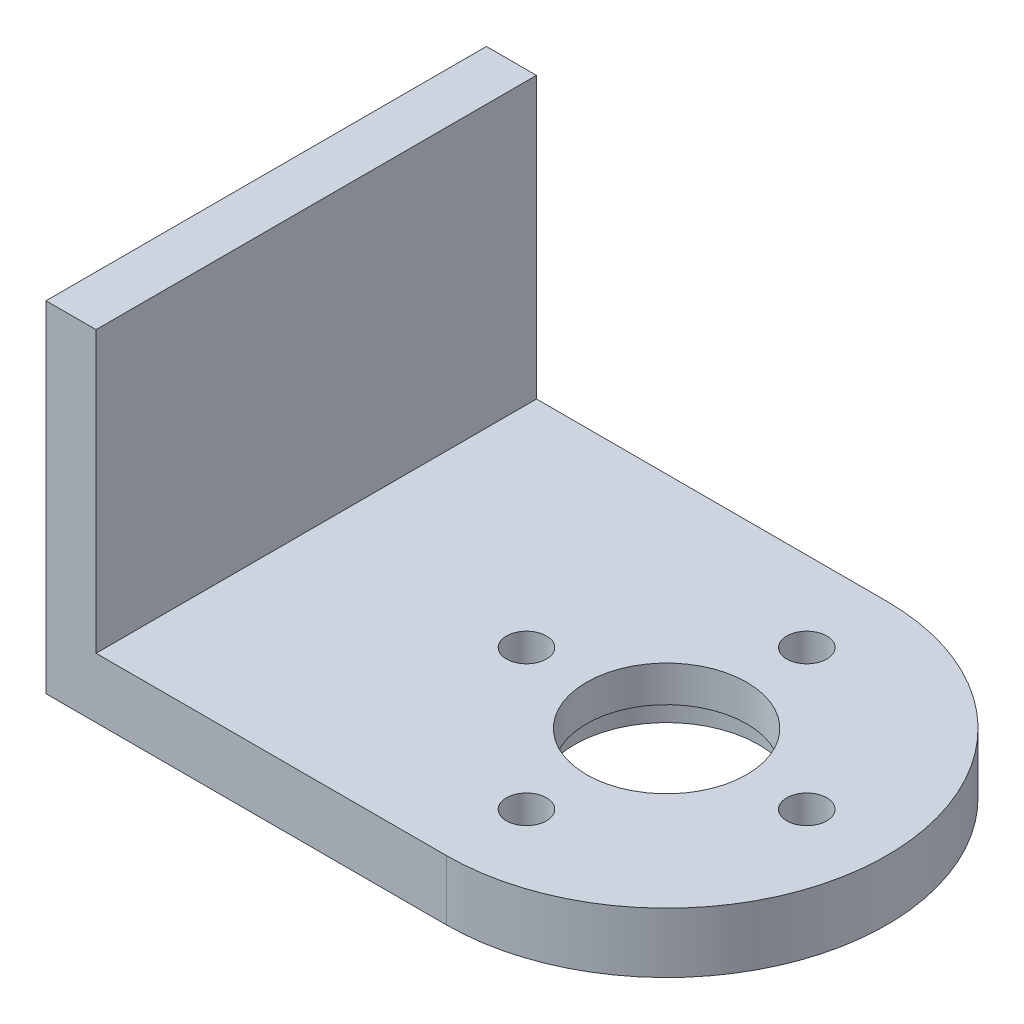
ISO-10303-21;
HEADER;
FILE_DESCRIPTION(('STEP AP214'),'2;1');
FILE_NAME('part.step','',(''),(''),'','','');
FILE_SCHEMA(('AUTOMOTIVE_DESIGN { 1 0 10303 214 1 1 1 1 }'));
ENDSEC;
DATA;
#1=APPLICATION_CONTEXT('core data for automotive mechanical design processes');
#2=APPLICATION_PROTOCOL_DEFINITION('international standard','automotive_design',2000,#1);
#3=PRODUCT_CONTEXT('',#1,'mechanical');
#4=PRODUCT('Part','Part','',(#3));
#5=PRODUCT_RELATED_PRODUCT_CATEGORY('part','',(#4));
#6=PRODUCT_DEFINITION_FORMATION('','',#4);
#7=PRODUCT_DEFINITION_CONTEXT('part definition',#1,'design');
#8=PRODUCT_DEFINITION('design','',#6,#7);
#9=PRODUCT_DEFINITION_SHAPE('','',#8);
#10=(LENGTH_UNIT() NAMED_UNIT(*) SI_UNIT(.MILLI.,.METRE.));
#11=(NAMED_UNIT(*) PLANE_ANGLE_UNIT() SI_UNIT($,.RADIAN.));
#12=(NAMED_UNIT(*) SI_UNIT($,.STERADIAN.) SOLID_ANGLE_UNIT());
#13=UNCERTAINTY_MEASURE_WITH_UNIT(LENGTH_MEASURE(1.E-05),#10,'distance_accuracy_value','');
#14=(GEOMETRIC_REPRESENTATION_CONTEXT(3) GLOBAL_UNCERTAINTY_ASSIGNED_CONTEXT((#13)) GLOBAL_UNIT_ASSIGNED_CONTEXT((#10,
#11,#12)) REPRESENTATION_CONTEXT('',''));
#15=CARTESIAN_POINT('',(0.,0.,0.));
#16=DIRECTION('',(0.,0.,1.));
#17=DIRECTION('',(1.,0.,0.));
#18=AXIS2_PLACEMENT_3D('',#15,#16,#17);
#19=CARTESIAN_POINT('',(5.99999999999998,3.,7.));
#20=DIRECTION('',(0.,-1.,0.));
#21=DIRECTION('',(0.,0.,-1.));
#22=AXIS2_PLACEMENT_3D('',#19,#20,#21);
#23=CYLINDRICAL_SURFACE('',#22,1.);
#24=CARTESIAN_POINT('',(5.99999999999998,3.,7.));
#25=DIRECTION('',(0.,1.,0.));
#26=DIRECTION('',(0.,0.,1.));
#27=AXIS2_PLACEMENT_3D('',#24,#25,#26);
#28=CIRCLE('',#27,1.);
#29=CARTESIAN_POINT('',(5.99999999999998,3.,8.));
#30=VERTEX_POINT('',#29);
#31=EDGE_CURVE('E171',#30,#30,#28,.T.);
#32=ORIENTED_EDGE('',*,*,#31,.T.);
#33=EDGE_LOOP('',(#32));
#34=FACE_BOUND('',#33,.T.);
#35=CARTESIAN_POINT('',(5.99999999999998,1.5,7.));
#36=DIRECTION('',(0.,-1.,0.));
#37=DIRECTION('',(0.,0.,-1.));
#38=AXIS2_PLACEMENT_3D('',#35,#36,#37);
#39=CIRCLE('',#38,1.);
#40=CARTESIAN_POINT('',(5.99999999999998,1.5,6.));
#41=VERTEX_POINT('',#40);
#42=EDGE_CURVE('E38',#41,#41,#39,.T.);
#43=ORIENTED_EDGE('',*,*,#42,.T.);
#44=EDGE_LOOP('',(#43));
#45=FACE_BOUND('',#44,.T.);
#46=ADVANCED_FACE('F34',(#34,#45),#23,.F.);
#47=CARTESIAN_POINT('',(-1.,3.,0.));
#48=DIRECTION('',(0.,-1.,0.));
#49=DIRECTION('',(0.,0.,-1.));
#50=AXIS2_PLACEMENT_3D('',#47,#48,#49);
#51=CYLINDRICAL_SURFACE('',#50,1.);
#52=CARTESIAN_POINT('',(-1.,3.,0.));
#53=DIRECTION('',(0.,1.,0.));
#54=DIRECTION('',(0.,0.,1.));
#55=AXIS2_PLACEMENT_3D('',#52,#53,#54);
#56=CIRCLE('',#55,1.);
#57=CARTESIAN_POINT('',(-1.,3.,0.999999999999951));
#58=VERTEX_POINT('',#57);
#59=EDGE_CURVE('E168',#58,#58,#56,.T.);
#60=ORIENTED_EDGE('',*,*,#59,.T.);
#61=EDGE_LOOP('',(#60));
#62=FACE_BOUND('',#61,.T.);
#63=CARTESIAN_POINT('',(-1.,1.5,0.));
#64=DIRECTION('',(0.,-1.,0.));
#65=DIRECTION('',(0.,0.,-1.));
#66=AXIS2_PLACEMENT_3D('',#63,#64,#65);
#67=CIRCLE('',#66,1.);
#68=CARTESIAN_POINT('',(-1.,1.5,-1.00000000000005));
#69=VERTEX_POINT('',#68);
#70=EDGE_CURVE('E128',#69,#69,#67,.T.);
#71=ORIENTED_EDGE('',*,*,#70,.T.);
#72=EDGE_LOOP('',(#71));
#73=FACE_BOUND('',#72,.T.);
#74=ADVANCED_FACE('F204',(#62,#73),#51,.F.);
#75=CARTESIAN_POINT('',(6.00000000000008,3.,-7.));
#76=DIRECTION('',(0.,-1.,0.));
#77=DIRECTION('',(0.,0.,-1.));
#78=AXIS2_PLACEMENT_3D('',#75,#76,#77);
#79=CYLINDRICAL_SURFACE('',#78,1.);
#80=CARTESIAN_POINT('',(6.00000000000008,3.,-7.));
#81=DIRECTION('',(0.,1.,0.));
#82=DIRECTION('',(0.,0.,1.));
#83=AXIS2_PLACEMENT_3D('',#80,#81,#82);
#84=CIRCLE('',#83,1.);
#85=CARTESIAN_POINT('',(6.00000000000008,3.,-6.));
#86=VERTEX_POINT('',#85);
#87=EDGE_CURVE('E165',#86,#86,#84,.T.);
#88=ORIENTED_EDGE('',*,*,#87,.T.);
#89=EDGE_LOOP('',(#88));
#90=FACE_BOUND('',#89,.T.);
#91=CARTESIAN_POINT('',(6.00000000000008,1.5,-7.));
#92=DIRECTION('',(0.,-1.,0.));
#93=DIRECTION('',(0.,0.,-1.));
#94=AXIS2_PLACEMENT_3D('',#91,#92,#93);
#95=CIRCLE('',#94,1.);
#96=CARTESIAN_POINT('',(6.00000000000008,1.5,-8.));
#97=VERTEX_POINT('',#96);
#98=EDGE_CURVE('E126',#97,#97,#95,.T.);
#99=ORIENTED_EDGE('',*,*,#98,.T.);
#100=EDGE_LOOP('',(#99));
#101=FACE_BOUND('',#100,.T.);
#102=ADVANCED_FACE('F210',(#90,#101),#79,.F.);
#103=CARTESIAN_POINT('',(13.,3.,0.));
#104=DIRECTION('',(0.,-1.,0.));
#105=DIRECTION('',(0.,0.,-1.));
#106=AXIS2_PLACEMENT_3D('',#103,#104,#105);
#107=CYLINDRICAL_SURFACE('',#106,1.);
#108=CARTESIAN_POINT('',(13.,3.,0.));
#109=DIRECTION('',(0.,1.,0.));
#110=DIRECTION('',(0.,0.,1.));
#111=AXIS2_PLACEMENT_3D('',#108,#109,#110);
#112=CIRCLE('',#111,1.);
#113=CARTESIAN_POINT('',(13.,3.,1.));
#114=VERTEX_POINT('',#113);
#115=EDGE_CURVE('E104',#114,#114,#112,.T.);
#116=ORIENTED_EDGE('',*,*,#115,.T.);
#117=EDGE_LOOP('',(#116));
#118=FACE_BOUND('',#117,.T.);
#119=CARTESIAN_POINT('',(13.,1.5,0.));
#120=DIRECTION('',(0.,-1.,0.));
#121=DIRECTION('',(0.,0.,-1.));
#122=AXIS2_PLACEMENT_3D('',#119,#120,#121);
#123=CIRCLE('',#122,1.);
#124=CARTESIAN_POINT('',(13.,1.5,-1.));
#125=VERTEX_POINT('',#124);
#126=EDGE_CURVE('E121',#125,#125,#123,.T.);
#127=ORIENTED_EDGE('',*,*,#126,.T.);
#128=EDGE_LOOP('',(#127));
#129=FACE_BOUND('',#128,.T.);
#130=ADVANCED_FACE('F218',(#118,#129),#107,.F.);
#131=CARTESIAN_POINT('',(6.,3.,0.));
#132=DIRECTION('',(0.,-1.,0.));
#133=DIRECTION('',(0.,0.,-1.));
#134=AXIS2_PLACEMENT_3D('',#131,#132,#133);
#135=CYLINDRICAL_SURFACE('',#134,4.);
#136=CARTESIAN_POINT('',(6.,3.,0.));
#137=DIRECTION('',(0.,1.,0.));
#138=DIRECTION('',(0.,0.,1.));
#139=AXIS2_PLACEMENT_3D('',#136,#137,#138);
#140=CIRCLE('',#139,4.);
#141=CARTESIAN_POINT('',(6.,3.,4.));
#142=VERTEX_POINT('',#141);
#143=EDGE_CURVE('E108',#142,#142,#140,.T.);
#144=ORIENTED_EDGE('',*,*,#143,.T.);
#145=EDGE_LOOP('',(#144));
#146=FACE_BOUND('',#145,.T.);
#147=CARTESIAN_POINT('',(6.,1.2,0.));
#148=DIRECTION('',(0.,-1.,0.));
#149=DIRECTION('',(0.,0.,-1.));
#150=AXIS2_PLACEMENT_3D('',#147,#148,#149);
#151=CIRCLE('',#150,4.);
#152=CARTESIAN_POINT('',(6.,1.2,-4.));
#153=VERTEX_POINT('',#152);
#154=EDGE_CURVE('E117',#153,#153,#151,.T.);
#155=ORIENTED_EDGE('',*,*,#154,.T.);
#156=EDGE_LOOP('',(#155));
#157=FACE_BOUND('',#156,.T.);
#158=ADVANCED_FACE('F215',(#146,#157),#135,.F.);
#159=CARTESIAN_POINT('',(6.,3.,0.));
#160=DIRECTION('',(0.,1.,0.));
#161=DIRECTION('',(0.,0.,1.));
#162=AXIS2_PLACEMENT_3D('',#159,#160,#161);
#163=PLANE('',#162);
#164=DIRECTION('',(0.,0.,-1.));
#165=VECTOR('',#164,1.);
#166=CARTESIAN_POINT('',(-11.5,3.,-11.));
#167=LINE('',#166,#165);
#168=CARTESIAN_POINT('',(-11.5,3.,11.));
#169=VERTEX_POINT('',#168);
#170=CARTESIAN_POINT('',(-11.5,3.,-11.));
#171=VERTEX_POINT('',#170);
#172=EDGE_CURVE('E51',#169,#171,#167,.T.);
#173=ORIENTED_EDGE('',*,*,#172,.F.);
#174=DIRECTION('',(1.,0.,0.));
#175=VECTOR('',#174,1.);
#176=CARTESIAN_POINT('',(6.,3.,11.));
#177=LINE('',#176,#175);
#178=CARTESIAN_POINT('',(6.,3.,11.));
#179=VERTEX_POINT('',#178);
#180=EDGE_CURVE('E89',#169,#179,#177,.T.);
#181=ORIENTED_EDGE('',*,*,#180,.T.);
#182=CARTESIAN_POINT('',(6.,3.,0.));
#183=DIRECTION('',(0.,1.,0.));
#184=DIRECTION('',(0.,0.,1.));
#185=AXIS2_PLACEMENT_3D('',#182,#183,#184);
#186=CIRCLE('',#185,11.);
#187=CARTESIAN_POINT('',(6.,3.,-11.));
#188=VERTEX_POINT('',#187);
#189=EDGE_CURVE('E57',#179,#188,#186,.T.);
#190=ORIENTED_EDGE('',*,*,#189,.T.);
#191=DIRECTION('',(-1.,0.,0.));
#192=VECTOR('',#191,1.);
#193=CARTESIAN_POINT('',(-14.,3.,-11.));
#194=LINE('',#193,#192);
#195=EDGE_CURVE('E100',#188,#171,#194,.T.);
#196=ORIENTED_EDGE('',*,*,#195,.T.);
#197=EDGE_LOOP('',(#173,#181,#190,#196));
#198=FACE_BOUND('',#197,.T.);
#199=ORIENTED_EDGE('',*,*,#59,.F.);
#200=EDGE_LOOP('',(#199));
#201=FACE_BOUND('',#200,.T.);
#202=ORIENTED_EDGE('',*,*,#143,.F.);
#203=EDGE_LOOP('',(#202));
#204=FACE_BOUND('',#203,.T.);
#205=ORIENTED_EDGE('',*,*,#115,.F.);
#206=EDGE_LOOP('',(#205));
#207=FACE_BOUND('',#206,.T.);
#208=ORIENTED_EDGE('',*,*,#31,.F.);
#209=EDGE_LOOP('',(#208));
#210=FACE_BOUND('',#209,.T.);
#211=ORIENTED_EDGE('',*,*,#87,.F.);
#212=EDGE_LOOP('',(#211));
#213=FACE_BOUND('',#212,.T.);
#214=ADVANCED_FACE('F178',(#198,#201,#204,#207,#210,#213),#163,.T.);
#215=CARTESIAN_POINT('',(6.,0.,0.));
#216=DIRECTION('',(0.,1.,0.));
#217=DIRECTION('',(0.,0.,1.));
#218=AXIS2_PLACEMENT_3D('',#215,#216,#217);
#219=PLANE('',#218);
#220=CARTESIAN_POINT('',(5.99999999999415,0.,-6.99999999999538));
#221=DIRECTION('',(0.,-1.,0.));
#222=DIRECTION('',(0.,0.,-1.));
#223=AXIS2_PLACEMENT_3D('',#220,#221,#222);
#224=CIRCLE('',#223,1.9);
#225=CARTESIAN_POINT('',(5.99999999999415,0.,-8.89999999999538));
#226=VERTEX_POINT('',#225);
#227=EDGE_CURVE('E256',#226,#226,#224,.T.);
#228=ORIENTED_EDGE('',*,*,#227,.F.);
#229=EDGE_LOOP('',(#228));
#230=FACE_BOUND('',#229,.T.);
#231=CARTESIAN_POINT('',(-1.00000000000121,0.,1.04930458969917E-11));
#232=DIRECTION('',(0.,-1.,0.));
#233=DIRECTION('',(0.,0.,-1.));
#234=AXIS2_PLACEMENT_3D('',#231,#232,#233);
#235=CIRCLE('',#234,1.9);
#236=CARTESIAN_POINT('',(-1.00000000000121,0.,-1.89999999998951));
#237=VERTEX_POINT('',#236);
#238=EDGE_CURVE('E264',#237,#237,#235,.T.);
#239=ORIENTED_EDGE('',*,*,#238,.F.);
#240=EDGE_LOOP('',(#239));
#241=FACE_BOUND('',#240,.T.);
#242=CARTESIAN_POINT('',(6.00000000000469,0.,7.00000000000583));
#243=DIRECTION('',(0.,-1.,0.));
#244=DIRECTION('',(0.,0.,-1.));
#245=AXIS2_PLACEMENT_3D('',#242,#243,#244);
#246=CIRCLE('',#245,1.9);
#247=CARTESIAN_POINT('',(6.00000000000469,0.,5.10000000000583));
#248=VERTEX_POINT('',#247);
#249=EDGE_CURVE('E269',#248,#248,#246,.T.);
#250=ORIENTED_EDGE('',*,*,#249,.F.);
#251=EDGE_LOOP('',(#250));
#252=FACE_BOUND('',#251,.T.);
#253=CARTESIAN_POINT('',(13.,0.,0.));
#254=DIRECTION('',(0.,-1.,0.));
#255=DIRECTION('',(0.,0.,-1.));
#256=AXIS2_PLACEMENT_3D('',#253,#254,#255);
#257=CIRCLE('',#256,1.9);
#258=CARTESIAN_POINT('',(13.,0.,-1.9));
#259=VERTEX_POINT('',#258);
#260=EDGE_CURVE('E134',#259,#259,#257,.T.);
#261=ORIENTED_EDGE('',*,*,#260,.F.);
#262=EDGE_LOOP('',(#261));
#263=FACE_BOUND('',#262,.T.);
#264=CARTESIAN_POINT('',(5.99999999999939,0.,5.22208257912396E-12));
#265=DIRECTION('',(0.,-1.,0.));
#266=DIRECTION('',(0.,0.,-1.));
#267=AXIS2_PLACEMENT_3D('',#264,#265,#266);
#268=CIRCLE('',#267,4.60000000001315);
#269=CARTESIAN_POINT('',(5.99999999999939,0.,-4.60000000000793));
#270=VERTEX_POINT('',#269);
#271=EDGE_CURVE('E124',#270,#270,#268,.T.);
#272=ORIENTED_EDGE('',*,*,#271,.F.);
#273=EDGE_LOOP('',(#272));
#274=FACE_BOUND('',#273,.T.);
#275=DIRECTION('',(1.,0.,0.));
#276=VECTOR('',#275,1.);
#277=CARTESIAN_POINT('',(6.,0.,11.));
#278=LINE('',#277,#276);
#279=CARTESIAN_POINT('',(-14.,0.,11.));
#280=VERTEX_POINT('',#279);
#281=CARTESIAN_POINT('',(6.,0.,11.));
#282=VERTEX_POINT('',#281);
#283=EDGE_CURVE('E95',#280,#282,#278,.T.);
#284=ORIENTED_EDGE('',*,*,#283,.F.);
#285=DIRECTION('',(0.,0.,1.));
#286=VECTOR('',#285,1.);
#287=CARTESIAN_POINT('',(-14.,0.,11.));
#288=LINE('',#287,#286);
#289=CARTESIAN_POINT('',(-14.,0.,-11.));
#290=VERTEX_POINT('',#289);
#291=EDGE_CURVE('E77',#290,#280,#288,.T.);
#292=ORIENTED_EDGE('',*,*,#291,.F.);
#293=DIRECTION('',(-1.,0.,0.));
#294=VECTOR('',#293,1.);
#295=CARTESIAN_POINT('',(-14.,0.,-11.));
#296=LINE('',#295,#294);
#297=CARTESIAN_POINT('',(6.,0.,-11.));
#298=VERTEX_POINT('',#297);
#299=EDGE_CURVE('E90',#298,#290,#296,.T.);
#300=ORIENTED_EDGE('',*,*,#299,.F.);
#301=CARTESIAN_POINT('',(6.,0.,0.));
#302=DIRECTION('',(0.,1.,0.));
#303=DIRECTION('',(0.,0.,1.));
#304=AXIS2_PLACEMENT_3D('',#301,#302,#303);
#305=CIRCLE('',#304,11.);
#306=EDGE_CURVE('E103',#282,#298,#305,.T.);
#307=ORIENTED_EDGE('',*,*,#306,.F.);
#308=EDGE_LOOP('',(#284,#292,#300,#307));
#309=FACE_BOUND('',#308,.T.);
#310=ADVANCED_FACE('F102',(#230,#241,#252,#263,#274,#309),#219,.F.);
#311=CARTESIAN_POINT('',(6.,3.,11.));
#312=DIRECTION('',(0.,0.,-1.));
#313=DIRECTION('',(-1.,0.,0.));
#314=AXIS2_PLACEMENT_3D('',#311,#312,#313);
#315=PLANE('',#314);
#316=ORIENTED_EDGE('',*,*,#283,.T.);
#317=DIRECTION('',(0.,-1.,0.));
#318=VECTOR('',#317,1.);
#319=CARTESIAN_POINT('',(6.,3.,11.));
#320=LINE('',#319,#318);
#321=EDGE_CURVE('E11',#179,#282,#320,.T.);
#322=ORIENTED_EDGE('',*,*,#321,.F.);
#323=ORIENTED_EDGE('',*,*,#180,.F.);
#324=DIRECTION('',(0.,-1.,0.));
#325=VECTOR('',#324,1.);
#326=CARTESIAN_POINT('',(-11.5,17.,11.));
#327=LINE('',#326,#325);
#328=CARTESIAN_POINT('',(-11.5,17.,11.));
#329=VERTEX_POINT('',#328);
#330=EDGE_CURVE('E162',#329,#169,#327,.T.);
#331=ORIENTED_EDGE('',*,*,#330,.F.);
#332=DIRECTION('',(1.,0.,0.));
#333=VECTOR('',#332,1.);
#334=CARTESIAN_POINT('',(-11.5,17.,11.));
#335=LINE('',#334,#333);
#336=CARTESIAN_POINT('',(-14.,17.,11.));
#337=VERTEX_POINT('',#336);
#338=EDGE_CURVE('E98',#337,#329,#335,.T.);
#339=ORIENTED_EDGE('',*,*,#338,.F.);
#340=DIRECTION('',(0.,-1.,0.));
#341=VECTOR('',#340,1.);
#342=CARTESIAN_POINT('',(-14.,3.,11.));
#343=LINE('',#342,#341);
#344=EDGE_CURVE('E82',#337,#280,#343,.T.);
#345=ORIENTED_EDGE('',*,*,#344,.T.);
#346=EDGE_LOOP('',(#316,#322,#323,#331,#339,#345));
#347=FACE_BOUND('',#346,.T.);
#348=ADVANCED_FACE('F36',(#347),#315,.F.);
#349=CARTESIAN_POINT('',(6.,3.,0.));
#350=DIRECTION('',(0.,-1.,0.));
#351=DIRECTION('',(0.,0.,-1.));
#352=AXIS2_PLACEMENT_3D('',#349,#350,#351);
#353=CYLINDRICAL_SURFACE('',#352,11.);
#354=ORIENTED_EDGE('',*,*,#306,.T.);
#355=DIRECTION('',(0.,-1.,0.));
#356=VECTOR('',#355,1.);
#357=CARTESIAN_POINT('',(6.,3.,-11.));
#358=LINE('',#357,#356);
#359=EDGE_CURVE('E43',#188,#298,#358,.T.);
#360=ORIENTED_EDGE('',*,*,#359,.F.);
#361=ORIENTED_EDGE('',*,*,#189,.F.);
#362=ORIENTED_EDGE('',*,*,#321,.T.);
#363=EDGE_LOOP('',(#354,#360,#361,#362));
#364=FACE_BOUND('',#363,.T.);
#365=ADVANCED_FACE('F196',(#364),#353,.T.);
#366=CARTESIAN_POINT('',(-14.,3.,-11.));
#367=DIRECTION('',(0.,0.,1.));
#368=DIRECTION('',(1.,0.,0.));
#369=AXIS2_PLACEMENT_3D('',#366,#367,#368);
#370=PLANE('',#369);
#371=ORIENTED_EDGE('',*,*,#299,.T.);
#372=DIRECTION('',(0.,-1.,0.));
#373=VECTOR('',#372,1.);
#374=CARTESIAN_POINT('',(-14.,3.,-11.));
#375=LINE('',#374,#373);
#376=CARTESIAN_POINT('',(-14.,17.,-11.));
#377=VERTEX_POINT('',#376);
#378=EDGE_CURVE('E85',#377,#290,#375,.T.);
#379=ORIENTED_EDGE('',*,*,#378,.F.);
#380=DIRECTION('',(-1.,0.,0.));
#381=VECTOR('',#380,1.);
#382=CARTESIAN_POINT('',(-14.,17.,-11.));
#383=LINE('',#382,#381);
#384=CARTESIAN_POINT('',(-11.5,17.,-11.));
#385=VERTEX_POINT('',#384);
#386=EDGE_CURVE('E155',#385,#377,#383,.T.);
#387=ORIENTED_EDGE('',*,*,#386,.F.);
#388=DIRECTION('',(0.,-1.,0.));
#389=VECTOR('',#388,1.);
#390=CARTESIAN_POINT('',(-11.5,17.,-11.));
#391=LINE('',#390,#389);
#392=EDGE_CURVE('E158',#385,#171,#391,.T.);
#393=ORIENTED_EDGE('',*,*,#392,.T.);
#394=ORIENTED_EDGE('',*,*,#195,.F.);
#395=ORIENTED_EDGE('',*,*,#359,.T.);
#396=EDGE_LOOP('',(#371,#379,#387,#393,#394,#395));
#397=FACE_BOUND('',#396,.T.);
#398=ADVANCED_FACE('F187',(#397),#370,.F.);
#399=CARTESIAN_POINT('',(-14.,3.,11.));
#400=DIRECTION('',(1.,0.,0.));
#401=DIRECTION('',(0.,0.,-1.));
#402=AXIS2_PLACEMENT_3D('',#399,#400,#401);
#403=PLANE('',#402);
#404=ORIENTED_EDGE('',*,*,#291,.T.);
#405=ORIENTED_EDGE('',*,*,#344,.F.);
#406=DIRECTION('',(0.,0.,1.));
#407=VECTOR('',#406,1.);
#408=CARTESIAN_POINT('',(-14.,17.,-11.));
#409=LINE('',#408,#407);
#410=EDGE_CURVE('E149',#377,#337,#409,.T.);
#411=ORIENTED_EDGE('',*,*,#410,.F.);
#412=ORIENTED_EDGE('',*,*,#378,.T.);
#413=EDGE_LOOP('',(#404,#405,#411,#412));
#414=FACE_BOUND('',#413,.T.);
#415=ADVANCED_FACE('F79',(#414),#403,.F.);
#416=CARTESIAN_POINT('',(-11.5,17.,-11.));
#417=DIRECTION('',(-1.,0.,0.));
#418=DIRECTION('',(0.,0.,1.));
#419=AXIS2_PLACEMENT_3D('',#416,#417,#418);
#420=PLANE('',#419);
#421=ORIENTED_EDGE('',*,*,#172,.T.);
#422=ORIENTED_EDGE('',*,*,#392,.F.);
#423=DIRECTION('',(0.,0.,-1.));
#424=VECTOR('',#423,1.);
#425=CARTESIAN_POINT('',(-11.5,17.,-11.));
#426=LINE('',#425,#424);
#427=EDGE_CURVE('E152',#329,#385,#426,.T.);
#428=ORIENTED_EDGE('',*,*,#427,.F.);
#429=ORIENTED_EDGE('',*,*,#330,.T.);
#430=EDGE_LOOP('',(#421,#422,#428,#429));
#431=FACE_BOUND('',#430,.T.);
#432=ADVANCED_FACE('F183',(#431),#420,.F.);
#433=CARTESIAN_POINT('',(0.,17.,0.));
#434=DIRECTION('',(0.,-1.,0.));
#435=DIRECTION('',(0.,0.,-1.));
#436=AXIS2_PLACEMENT_3D('',#433,#434,#435);
#437=PLANE('',#436);
#438=ORIENTED_EDGE('',*,*,#410,.T.);
#439=ORIENTED_EDGE('',*,*,#338,.T.);
#440=ORIENTED_EDGE('',*,*,#427,.T.);
#441=ORIENTED_EDGE('',*,*,#386,.T.);
#442=EDGE_LOOP('',(#438,#439,#440,#441));
#443=FACE_BOUND('',#442,.T.);
#444=ADVANCED_FACE('F191',(#443),#437,.F.);
#445=CARTESIAN_POINT('',(5.99999999999939,1.2,5.22208257912396E-12));
#446=DIRECTION('',(0.,-1.,0.));
#447=DIRECTION('',(0.,0.,-1.));
#448=AXIS2_PLACEMENT_3D('',#445,#446,#447);
#449=CYLINDRICAL_SURFACE('',#448,4.60000000001315);
#450=CARTESIAN_POINT('',(5.99999999999939,1.2,5.22208257912396E-12));
#451=DIRECTION('',(0.,-1.,0.));
#452=DIRECTION('',(0.,0.,-1.));
#453=AXIS2_PLACEMENT_3D('',#450,#451,#452);
#454=CIRCLE('',#453,4.60000000001315);
#455=CARTESIAN_POINT('',(5.99999999999939,1.2,-4.60000000000793));
#456=VERTEX_POINT('',#455);
#457=EDGE_CURVE('E120',#456,#456,#454,.T.);
#458=ORIENTED_EDGE('',*,*,#457,.F.);
#459=EDGE_LOOP('',(#458));
#460=FACE_BOUND('',#459,.T.);
#461=ORIENTED_EDGE('',*,*,#271,.T.);
#462=EDGE_LOOP('',(#461));
#463=FACE_BOUND('',#462,.T.);
#464=ADVANCED_FACE('F236',(#460,#463),#449,.F.);
#465=CARTESIAN_POINT('',(5.99999999999939,1.2,5.22208257912396E-12));
#466=DIRECTION('',(0.,-1.,0.));
#467=DIRECTION('',(0.,0.,-1.));
#468=AXIS2_PLACEMENT_3D('',#465,#466,#467);
#469=PLANE('',#468);
#470=ORIENTED_EDGE('',*,*,#154,.F.);
#471=EDGE_LOOP('',(#470));
#472=FACE_BOUND('',#471,.T.);
#473=ORIENTED_EDGE('',*,*,#457,.T.);
#474=EDGE_LOOP('',(#473));
#475=FACE_BOUND('',#474,.T.);
#476=ADVANCED_FACE('F280',(#472,#475),#469,.T.);
#477=CARTESIAN_POINT('',(13.,1.5,0.));
#478=DIRECTION('',(0.,-1.,0.));
#479=DIRECTION('',(0.,0.,-1.));
#480=AXIS2_PLACEMENT_3D('',#477,#478,#479);
#481=CYLINDRICAL_SURFACE('',#480,1.9);
#482=CARTESIAN_POINT('',(13.,1.5,0.));
#483=DIRECTION('',(0.,-1.,0.));
#484=DIRECTION('',(0.,0.,-1.));
#485=AXIS2_PLACEMENT_3D('',#482,#483,#484);
#486=CIRCLE('',#485,1.9);
#487=CARTESIAN_POINT('',(13.,1.5,-1.9));
#488=VERTEX_POINT('',#487);
#489=EDGE_CURVE('E125',#488,#488,#486,.T.);
#490=ORIENTED_EDGE('',*,*,#489,.F.);
#491=EDGE_LOOP('',(#490));
#492=FACE_BOUND('',#491,.T.);
#493=ORIENTED_EDGE('',*,*,#260,.T.);
#494=EDGE_LOOP('',(#493));
#495=FACE_BOUND('',#494,.T.);
#496=ADVANCED_FACE('F285',(#492,#495),#481,.F.);
#497=CARTESIAN_POINT('',(13.,1.5,0.));
#498=DIRECTION('',(0.,-1.,0.));
#499=DIRECTION('',(0.,0.,-1.));
#500=AXIS2_PLACEMENT_3D('',#497,#498,#499);
#501=PLANE('',#500);
#502=ORIENTED_EDGE('',*,*,#126,.F.);
#503=EDGE_LOOP('',(#502));
#504=FACE_BOUND('',#503,.T.);
#505=ORIENTED_EDGE('',*,*,#489,.T.);
#506=EDGE_LOOP('',(#505));
#507=FACE_BOUND('',#506,.T.);
#508=ADVANCED_FACE('F292',(#504,#507),#501,.T.);
#509=CARTESIAN_POINT('',(5.99999999999415,1.5,-6.99999999999538));
#510=DIRECTION('',(0.,-1.,0.));
#511=DIRECTION('',(0.,0.,-1.));
#512=AXIS2_PLACEMENT_3D('',#509,#510,#511);
#513=CYLINDRICAL_SURFACE('',#512,1.9);
#514=CARTESIAN_POINT('',(5.99999999999415,1.5,-6.99999999999538));
#515=DIRECTION('',(0.,-1.,0.));
#516=DIRECTION('',(0.,0.,-1.));
#517=AXIS2_PLACEMENT_3D('',#514,#515,#516);
#518=CIRCLE('',#517,1.9);
#519=CARTESIAN_POINT('',(5.99999999999415,1.5,-8.89999999999538));
#520=VERTEX_POINT('',#519);
#521=EDGE_CURVE('E129',#520,#520,#518,.T.);
#522=ORIENTED_EDGE('',*,*,#521,.F.);
#523=EDGE_LOOP('',(#522));
#524=FACE_BOUND('',#523,.T.);
#525=ORIENTED_EDGE('',*,*,#227,.T.);
#526=EDGE_LOOP('',(#525));
#527=FACE_BOUND('',#526,.T.);
#528=ADVANCED_FACE('F251',(#524,#527),#513,.F.);
#529=CARTESIAN_POINT('',(5.99999999999415,1.5,-6.99999999999538));
#530=DIRECTION('',(0.,-1.,0.));
#531=DIRECTION('',(0.,0.,-1.));
#532=AXIS2_PLACEMENT_3D('',#529,#530,#531);
#533=PLANE('',#532);
#534=ORIENTED_EDGE('',*,*,#98,.F.);
#535=EDGE_LOOP('',(#534));
#536=FACE_BOUND('',#535,.T.);
#537=ORIENTED_EDGE('',*,*,#521,.T.);
#538=EDGE_LOOP('',(#537));
#539=FACE_BOUND('',#538,.T.);
#540=ADVANCED_FACE('F247',(#536,#539),#533,.T.);
#541=CARTESIAN_POINT('',(-1.00000000000121,1.5,1.04930458969917E-11));
#542=DIRECTION('',(0.,-1.,0.));
#543=DIRECTION('',(0.,0.,-1.));
#544=AXIS2_PLACEMENT_3D('',#541,#542,#543);
#545=CYLINDRICAL_SURFACE('',#544,1.9);
#546=CARTESIAN_POINT('',(-1.00000000000121,1.5,1.04930458969917E-11));
#547=DIRECTION('',(0.,-1.,0.));
#548=DIRECTION('',(0.,0.,-1.));
#549=AXIS2_PLACEMENT_3D('',#546,#547,#548);
#550=CIRCLE('',#549,1.9);
#551=CARTESIAN_POINT('',(-1.00000000000121,1.5,-1.89999999998951));
#552=VERTEX_POINT('',#551);
#553=EDGE_CURVE('E259',#552,#552,#550,.T.);
#554=ORIENTED_EDGE('',*,*,#553,.F.);
#555=EDGE_LOOP('',(#554));
#556=FACE_BOUND('',#555,.T.);
#557=ORIENTED_EDGE('',*,*,#238,.T.);
#558=EDGE_LOOP('',(#557));
#559=FACE_BOUND('',#558,.T.);
#560=ADVANCED_FACE('F250',(#556,#559),#545,.F.);
#561=CARTESIAN_POINT('',(-1.00000000000121,1.5,1.04930458969917E-11));
#562=DIRECTION('',(0.,-1.,0.));
#563=DIRECTION('',(0.,0.,-1.));
#564=AXIS2_PLACEMENT_3D('',#561,#562,#563);
#565=PLANE('',#564);
#566=ORIENTED_EDGE('',*,*,#70,.F.);
#567=EDGE_LOOP('',(#566));
#568=FACE_BOUND('',#567,.T.);
#569=ORIENTED_EDGE('',*,*,#553,.T.);
#570=EDGE_LOOP('',(#569));
#571=FACE_BOUND('',#570,.T.);
#572=ADVANCED_FACE('F300',(#568,#571),#565,.T.);
#573=CARTESIAN_POINT('',(6.00000000000469,1.5,7.00000000000583));
#574=DIRECTION('',(0.,-1.,0.));
#575=DIRECTION('',(0.,0.,-1.));
#576=AXIS2_PLACEMENT_3D('',#573,#574,#575);
#577=CYLINDRICAL_SURFACE('',#576,1.9);
#578=CARTESIAN_POINT('',(6.00000000000469,1.5,7.00000000000583));
#579=DIRECTION('',(0.,-1.,0.));
#580=DIRECTION('',(0.,0.,-1.));
#581=AXIS2_PLACEMENT_3D('',#578,#579,#580);
#582=CIRCLE('',#581,1.9);
#583=CARTESIAN_POINT('',(6.00000000000469,1.5,5.10000000000583));
#584=VERTEX_POINT('',#583);
#585=EDGE_CURVE('E267',#584,#584,#582,.T.);
#586=ORIENTED_EDGE('',*,*,#585,.F.);
#587=EDGE_LOOP('',(#586));
#588=FACE_BOUND('',#587,.T.);
#589=ORIENTED_EDGE('',*,*,#249,.T.);
#590=EDGE_LOOP('',(#589));
#591=FACE_BOUND('',#590,.T.);
#592=ADVANCED_FACE('F273',(#588,#591),#577,.F.);
#593=CARTESIAN_POINT('',(6.00000000000469,1.5,7.00000000000583));
#594=DIRECTION('',(0.,-1.,0.));
#595=DIRECTION('',(0.,0.,-1.));
#596=AXIS2_PLACEMENT_3D('',#593,#594,#595);
#597=PLANE('',#596);
#598=ORIENTED_EDGE('',*,*,#42,.F.);
#599=EDGE_LOOP('',(#598));
#600=FACE_BOUND('',#599,.T.);
#601=ORIENTED_EDGE('',*,*,#585,.T.);
#602=EDGE_LOOP('',(#601));
#603=FACE_BOUND('',#602,.T.);
#604=ADVANCED_FACE('F299',(#600,#603),#597,.T.);
#605=CLOSED_SHELL('',(#46,#74,#102,#130,#158,#214,#310,#348,#365,#398,#415,#432,#444,#464,#476,
#496,#508,#528,#540,#560,#572,#592,#604));
#606=MANIFOLD_SOLID_BREP('B2',#605);
#607=ADVANCED_BREP_SHAPE_REPRESENTATION('',(#18,#606),#14);
#608=SHAPE_DEFINITION_REPRESENTATION(#9,#607);
ENDSEC;
END-ISO-10303-21;
